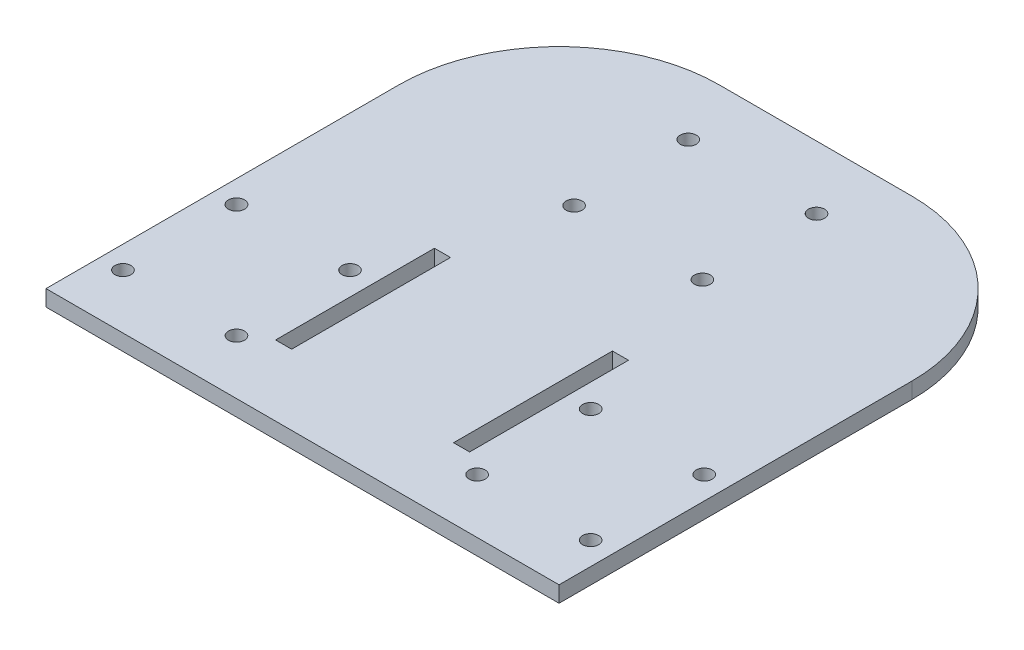
ISO-10303-21;
HEADER;
FILE_DESCRIPTION(('STEP AP214'),'2;1');
FILE_NAME('part.step','',(''),(''),'','','');
FILE_SCHEMA(('AUTOMOTIVE_DESIGN { 1 0 10303 214 1 1 1 1 }'));
ENDSEC;
DATA;
#1=APPLICATION_CONTEXT('core data for automotive mechanical design processes');
#2=APPLICATION_PROTOCOL_DEFINITION('international standard','automotive_design',2000,#1);
#3=PRODUCT_CONTEXT('',#1,'mechanical');
#4=PRODUCT('Part','Part','',(#3));
#5=PRODUCT_RELATED_PRODUCT_CATEGORY('part','',(#4));
#6=PRODUCT_DEFINITION_FORMATION('','',#4);
#7=PRODUCT_DEFINITION_CONTEXT('part definition',#1,'design');
#8=PRODUCT_DEFINITION('design','',#6,#7);
#9=PRODUCT_DEFINITION_SHAPE('','',#8);
#10=(LENGTH_UNIT() NAMED_UNIT(*) SI_UNIT(.MILLI.,.METRE.));
#11=(NAMED_UNIT(*) PLANE_ANGLE_UNIT() SI_UNIT($,.RADIAN.));
#12=(NAMED_UNIT(*) SI_UNIT($,.STERADIAN.) SOLID_ANGLE_UNIT());
#13=UNCERTAINTY_MEASURE_WITH_UNIT(LENGTH_MEASURE(1.E-05),#10,'distance_accuracy_value','');
#14=(GEOMETRIC_REPRESENTATION_CONTEXT(3) GLOBAL_UNCERTAINTY_ASSIGNED_CONTEXT((#13)) GLOBAL_UNIT_ASSIGNED_CONTEXT((#10,
#11,#12)) REPRESENTATION_CONTEXT('',''));
#15=CARTESIAN_POINT('',(0.,0.,0.));
#16=DIRECTION('',(0.,0.,1.));
#17=DIRECTION('',(1.,0.,0.));
#18=AXIS2_PLACEMENT_3D('',#15,#16,#17);
#19=CARTESIAN_POINT('',(101.6,6.35,101.6));
#20=DIRECTION('',(-1.,0.,0.));
#21=DIRECTION('',(0.,0.,1.));
#22=AXIS2_PLACEMENT_3D('',#19,#20,#21);
#23=PLANE('',#22);
#24=DIRECTION('',(0.,1.,0.));
#25=VECTOR('',#24,1.);
#26=CARTESIAN_POINT('',(101.6,0.,-38.0999999999999));
#27=LINE('',#26,#25);
#28=CARTESIAN_POINT('',(101.6,0.,-38.0999999999999));
#29=VERTEX_POINT('',#28);
#30=CARTESIAN_POINT('',(101.6,6.35,-38.0999999999999));
#31=VERTEX_POINT('',#30);
#32=EDGE_CURVE('E252',#29,#31,#27,.T.);
#33=ORIENTED_EDGE('',*,*,#32,.T.);
#34=DIRECTION('',(0.,0.,-1.));
#35=VECTOR('',#34,1.);
#36=CARTESIAN_POINT('',(101.6,6.35,101.6));
#37=LINE('',#36,#35);
#38=CARTESIAN_POINT('',(101.6,6.35,101.6));
#39=VERTEX_POINT('',#38);
#40=EDGE_CURVE('E269',#39,#31,#37,.T.);
#41=ORIENTED_EDGE('',*,*,#40,.F.);
#42=DIRECTION('',(0.,-1.,0.));
#43=VECTOR('',#42,1.);
#44=CARTESIAN_POINT('',(101.6,6.35,101.6));
#45=LINE('',#44,#43);
#46=CARTESIAN_POINT('',(101.6,0.,101.6));
#47=VERTEX_POINT('',#46);
#48=EDGE_CURVE('E39',#39,#47,#45,.T.);
#49=ORIENTED_EDGE('',*,*,#48,.T.);
#50=DIRECTION('',(0.,0.,-1.));
#51=VECTOR('',#50,1.);
#52=CARTESIAN_POINT('',(101.6,0.,101.6));
#53=LINE('',#52,#51);
#54=EDGE_CURVE('E258',#47,#29,#53,.T.);
#55=ORIENTED_EDGE('',*,*,#54,.T.);
#56=EDGE_LOOP('',(#33,#41,#49,#55));
#57=FACE_BOUND('',#56,.T.);
#58=ADVANCED_FACE('F32',(#57),#23,.F.);
#59=CARTESIAN_POINT('',(-101.6,6.35,-101.6));
#60=DIRECTION('',(0.,0.,1.));
#61=DIRECTION('',(1.,0.,0.));
#62=AXIS2_PLACEMENT_3D('',#59,#60,#61);
#63=PLANE('',#62);
#64=DIRECTION('',(-1.,0.,0.));
#65=VECTOR('',#64,1.);
#66=CARTESIAN_POINT('',(-101.6,6.35,-101.6));
#67=LINE('',#66,#65);
#68=CARTESIAN_POINT('',(38.0999999999998,6.35,-101.6));
#69=VERTEX_POINT('',#68);
#70=CARTESIAN_POINT('',(-38.0999999999998,6.35,-101.6));
#71=VERTEX_POINT('',#70);
#72=EDGE_CURVE('E272',#69,#71,#67,.T.);
#73=ORIENTED_EDGE('',*,*,#72,.F.);
#74=DIRECTION('',(0.,1.,0.));
#75=VECTOR('',#74,1.);
#76=CARTESIAN_POINT('',(38.0999999999998,0.,-101.6));
#77=LINE('',#76,#75);
#78=CARTESIAN_POINT('',(38.0999999999998,0.,-101.6));
#79=VERTEX_POINT('',#78);
#80=EDGE_CURVE('E256',#79,#69,#77,.T.);
#81=ORIENTED_EDGE('',*,*,#80,.F.);
#82=DIRECTION('',(-1.,0.,0.));
#83=VECTOR('',#82,1.);
#84=CARTESIAN_POINT('',(-101.6,0.,-101.6));
#85=LINE('',#84,#83);
#86=CARTESIAN_POINT('',(-38.0999999999998,0.,-101.6));
#87=VERTEX_POINT('',#86);
#88=EDGE_CURVE('E282',#79,#87,#85,.T.);
#89=ORIENTED_EDGE('',*,*,#88,.T.);
#90=DIRECTION('',(0.,1.,0.));
#91=VECTOR('',#90,1.);
#92=CARTESIAN_POINT('',(-38.0999999999998,0.,-101.6));
#93=LINE('',#92,#91);
#94=EDGE_CURVE('E264',#87,#71,#93,.T.);
#95=ORIENTED_EDGE('',*,*,#94,.T.);
#96=EDGE_LOOP('',(#73,#81,#89,#95));
#97=FACE_BOUND('',#96,.T.);
#98=ADVANCED_FACE('F305',(#97),#63,.F.);
#99=CARTESIAN_POINT('',(-101.6,6.35,101.6));
#100=DIRECTION('',(1.,0.,0.));
#101=DIRECTION('',(0.,0.,-1.));
#102=AXIS2_PLACEMENT_3D('',#99,#100,#101);
#103=PLANE('',#102);
#104=DIRECTION('',(0.,0.,1.));
#105=VECTOR('',#104,1.);
#106=CARTESIAN_POINT('',(-101.6,6.35,101.6));
#107=LINE('',#106,#105);
#108=CARTESIAN_POINT('',(-101.6,6.35,-38.0999999999999));
#109=VERTEX_POINT('',#108);
#110=CARTESIAN_POINT('',(-101.6,6.35,101.6));
#111=VERTEX_POINT('',#110);
#112=EDGE_CURVE('E276',#109,#111,#107,.T.);
#113=ORIENTED_EDGE('',*,*,#112,.F.);
#114=DIRECTION('',(0.,1.,0.));
#115=VECTOR('',#114,1.);
#116=CARTESIAN_POINT('',(-101.6,0.,-38.0999999999999));
#117=LINE('',#116,#115);
#118=CARTESIAN_POINT('',(-101.6,0.,-38.0999999999999));
#119=VERTEX_POINT('',#118);
#120=EDGE_CURVE('E255',#119,#109,#117,.T.);
#121=ORIENTED_EDGE('',*,*,#120,.F.);
#122=DIRECTION('',(0.,0.,1.));
#123=VECTOR('',#122,1.);
#124=CARTESIAN_POINT('',(-101.6,0.,101.6));
#125=LINE('',#124,#123);
#126=CARTESIAN_POINT('',(-101.6,0.,101.6));
#127=VERTEX_POINT('',#126);
#128=EDGE_CURVE('E285',#119,#127,#125,.T.);
#129=ORIENTED_EDGE('',*,*,#128,.T.);
#130=DIRECTION('',(0.,-1.,0.));
#131=VECTOR('',#130,1.);
#132=CARTESIAN_POINT('',(-101.6,6.35,101.6));
#133=LINE('',#132,#131);
#134=EDGE_CURVE('E11',#111,#127,#133,.T.);
#135=ORIENTED_EDGE('',*,*,#134,.F.);
#136=EDGE_LOOP('',(#113,#121,#129,#135));
#137=FACE_BOUND('',#136,.T.);
#138=ADVANCED_FACE('F312',(#137),#103,.F.);
#139=CARTESIAN_POINT('',(-101.6,6.35,101.6));
#140=DIRECTION('',(0.,0.,-1.));
#141=DIRECTION('',(-1.,0.,0.));
#142=AXIS2_PLACEMENT_3D('',#139,#140,#141);
#143=PLANE('',#142);
#144=DIRECTION('',(1.,0.,0.));
#145=VECTOR('',#144,1.);
#146=CARTESIAN_POINT('',(-101.6,0.,101.6));
#147=LINE('',#146,#145);
#148=EDGE_CURVE('E273',#127,#47,#147,.T.);
#149=ORIENTED_EDGE('',*,*,#148,.T.);
#150=ORIENTED_EDGE('',*,*,#48,.F.);
#151=DIRECTION('',(1.,0.,0.));
#152=VECTOR('',#151,1.);
#153=CARTESIAN_POINT('',(-101.6,6.35,101.6));
#154=LINE('',#153,#152);
#155=EDGE_CURVE('E278',#111,#39,#154,.T.);
#156=ORIENTED_EDGE('',*,*,#155,.F.);
#157=ORIENTED_EDGE('',*,*,#134,.T.);
#158=EDGE_LOOP('',(#149,#150,#156,#157));
#159=FACE_BOUND('',#158,.T.);
#160=ADVANCED_FACE('F310',(#159),#143,.F.);
#161=CARTESIAN_POINT('',(0.,6.35,0.));
#162=DIRECTION('',(0.,-1.,0.));
#163=DIRECTION('',(0.,0.,-1.));
#164=AXIS2_PLACEMENT_3D('',#161,#162,#163);
#165=PLANE('',#164);
#166=DIRECTION('',(-1.,0.,0.));
#167=VECTOR('',#166,1.);
#168=CARTESIAN_POINT('',(-38.5120386701626,6.35,73.7559613298375));
#169=LINE('',#168,#167);
#170=CARTESIAN_POINT('',(-32.1620386701625,6.35,73.7559613298375));
#171=VERTEX_POINT('',#170);
#172=CARTESIAN_POINT('',(-38.5120386701626,6.35,73.7559613298375));
#173=VERTEX_POINT('',#172);
#174=EDGE_CURVE('E191',#171,#173,#169,.T.);
#175=ORIENTED_EDGE('',*,*,#174,.T.);
#176=DIRECTION('',(0.,0.,-1.));
#177=VECTOR('',#176,1.);
#178=CARTESIAN_POINT('',(-38.5120386701626,6.35,10.8317438789309));
#179=LINE('',#178,#177);
#180=CARTESIAN_POINT('',(-38.5120386701626,6.35,10.8317438789309));
#181=VERTEX_POINT('',#180);
#182=EDGE_CURVE('E183',#173,#181,#179,.T.);
#183=ORIENTED_EDGE('',*,*,#182,.T.);
#184=DIRECTION('',(1.,0.,0.));
#185=VECTOR('',#184,1.);
#186=CARTESIAN_POINT('',(-38.5120386701626,6.35,10.8317438789309));
#187=LINE('',#186,#185);
#188=CARTESIAN_POINT('',(-32.1620386701625,6.35,10.8317438789309));
#189=VERTEX_POINT('',#188);
#190=EDGE_CURVE('E186',#181,#189,#187,.T.);
#191=ORIENTED_EDGE('',*,*,#190,.T.);
#192=DIRECTION('',(0.,0.,1.));
#193=VECTOR('',#192,1.);
#194=CARTESIAN_POINT('',(-32.1620386701625,6.35,10.8317438789309));
#195=LINE('',#194,#193);
#196=EDGE_CURVE('E46',#189,#171,#195,.T.);
#197=ORIENTED_EDGE('',*,*,#196,.T.);
#198=EDGE_LOOP('',(#175,#183,#191,#197));
#199=FACE_BOUND('',#198,.T.);
#200=CARTESIAN_POINT('',(-92.71,6.35,80.0157052087683));
#201=DIRECTION('',(0.,-1.,0.));
#202=DIRECTION('',(0.,0.,-1.));
#203=AXIS2_PLACEMENT_3D('',#200,#201,#202);
#204=CIRCLE('',#203,3.175);
#205=CARTESIAN_POINT('',(-92.71,6.35,76.8407052087683));
#206=VERTEX_POINT('',#205);
#207=EDGE_CURVE('E198',#206,#206,#204,.T.);
#208=ORIENTED_EDGE('',*,*,#207,.T.);
#209=EDGE_LOOP('',(#208));
#210=FACE_BOUND('',#209,.T.);
#211=DIRECTION('',(0.,0.,-1.));
#212=VECTOR('',#211,1.);
#213=CARTESIAN_POINT('',(31.9815264280242,6.35,73.7559613298375));
#214=LINE('',#213,#212);
#215=CARTESIAN_POINT('',(31.9815264280242,6.35,73.7559613298375));
#216=VERTEX_POINT('',#215);
#217=CARTESIAN_POINT('',(31.9815264280242,6.35,10.8317438789307));
#218=VERTEX_POINT('',#217);
#219=EDGE_CURVE('E144',#216,#218,#214,.T.);
#220=ORIENTED_EDGE('',*,*,#219,.T.);
#221=DIRECTION('',(1.,0.,0.));
#222=VECTOR('',#221,1.);
#223=CARTESIAN_POINT('',(38.3315264280242,6.35,10.8317438789307));
#224=LINE('',#223,#222);
#225=CARTESIAN_POINT('',(38.3315264280242,6.35,10.8317438789307));
#226=VERTEX_POINT('',#225);
#227=EDGE_CURVE('E136',#218,#226,#224,.T.);
#228=ORIENTED_EDGE('',*,*,#227,.T.);
#229=DIRECTION('',(0.,0.,1.));
#230=VECTOR('',#229,1.);
#231=CARTESIAN_POINT('',(38.3315264280242,6.35,73.7559613298375));
#232=LINE('',#231,#230);
#233=CARTESIAN_POINT('',(38.3315264280242,6.35,73.7559613298375));
#234=VERTEX_POINT('',#233);
#235=EDGE_CURVE('E147',#226,#234,#232,.T.);
#236=ORIENTED_EDGE('',*,*,#235,.T.);
#237=DIRECTION('',(-1.,0.,0.));
#238=VECTOR('',#237,1.);
#239=CARTESIAN_POINT('',(38.3315264280242,6.35,73.7559613298375));
#240=LINE('',#239,#238);
#241=EDGE_CURVE('E54',#234,#216,#240,.T.);
#242=ORIENTED_EDGE('',*,*,#241,.T.);
#243=EDGE_LOOP('',(#220,#228,#236,#242));
#244=FACE_BOUND('',#243,.T.);
#245=CARTESIAN_POINT('',(-47.7462947912317,6.35,35.0520000000001));
#246=DIRECTION('',(0.,-1.,0.));
#247=DIRECTION('',(0.,0.,-1.));
#248=AXIS2_PLACEMENT_3D('',#245,#246,#247);
#249=CIRCLE('',#248,3.16000827881765);
#250=CARTESIAN_POINT('',(-47.7462947912317,6.35,31.8919917211824));
#251=VERTEX_POINT('',#250);
#252=EDGE_CURVE('E167',#251,#251,#249,.T.);
#253=ORIENTED_EDGE('',*,*,#252,.T.);
#254=EDGE_LOOP('',(#253));
#255=FACE_BOUND('',#254,.T.);
#256=CARTESIAN_POINT('',(25.3097438789308,6.35,-31.4508386701625));
#257=DIRECTION('',(0.,-1.,0.));
#258=DIRECTION('',(0.,0.,-1.));
#259=AXIS2_PLACEMENT_3D('',#256,#257,#258);
#260=CIRCLE('',#259,3.175);
#261=CARTESIAN_POINT('',(25.3097438789308,6.35,-34.6258386701625));
#262=VERTEX_POINT('',#261);
#263=EDGE_CURVE('E231',#262,#262,#260,.T.);
#264=ORIENTED_EDGE('',*,*,#263,.T.);
#265=EDGE_LOOP('',(#264));
#266=FACE_BOUND('',#265,.T.);
#267=CARTESIAN_POINT('',(-25.4902561210691,6.35,-76.6628386701625));
#268=DIRECTION('',(0.,-1.,0.));
#269=DIRECTION('',(0.,0.,-1.));
#270=AXIS2_PLACEMENT_3D('',#267,#268,#269);
#271=CIRCLE('',#270,3.175);
#272=CARTESIAN_POINT('',(-25.4902561210691,6.35,-79.8378386701625));
#273=VERTEX_POINT('',#272);
#274=EDGE_CURVE('E238',#273,#273,#271,.T.);
#275=ORIENTED_EDGE('',*,*,#274,.T.);
#276=EDGE_LOOP('',(#275));
#277=FACE_BOUND('',#276,.T.);
#278=CARTESIAN_POINT('',(25.3097438789308,6.35,-76.6628386701625));
#279=DIRECTION('',(0.,-1.,0.));
#280=DIRECTION('',(0.,0.,-1.));
#281=AXIS2_PLACEMENT_3D('',#278,#279,#280);
#282=CIRCLE('',#281,3.175);
#283=CARTESIAN_POINT('',(25.3097438789308,6.35,-79.8378386701625));
#284=VERTEX_POINT('',#283);
#285=EDGE_CURVE('E219',#284,#284,#282,.T.);
#286=ORIENTED_EDGE('',*,*,#285,.T.);
#287=EDGE_LOOP('',(#286));
#288=FACE_BOUND('',#287,.T.);
#289=CARTESIAN_POINT('',(-47.7462947912317,6.35,80.0157052087683));
#290=DIRECTION('',(0.,-1.,0.));
#291=DIRECTION('',(0.,0.,-1.));
#292=AXIS2_PLACEMENT_3D('',#289,#290,#291);
#293=CIRCLE('',#292,3.175);
#294=CARTESIAN_POINT('',(-47.7462947912317,6.35,76.8407052087683));
#295=VERTEX_POINT('',#294);
#296=EDGE_CURVE('E226',#295,#295,#293,.T.);
#297=ORIENTED_EDGE('',*,*,#296,.T.);
#298=EDGE_LOOP('',(#297));
#299=FACE_BOUND('',#298,.T.);
#300=CARTESIAN_POINT('',(92.5294877578617,6.35,35.052));
#301=DIRECTION('',(0.,-1.,0.));
#302=DIRECTION('',(0.,0.,-1.));
#303=AXIS2_PLACEMENT_3D('',#300,#301,#302);
#304=CIRCLE('',#303,3.175);
#305=CARTESIAN_POINT('',(92.5294877578617,6.35,31.877));
#306=VERTEX_POINT('',#305);
#307=EDGE_CURVE('E464',#306,#306,#304,.T.);
#308=ORIENTED_EDGE('',*,*,#307,.T.);
#309=EDGE_LOOP('',(#308));
#310=FACE_BOUND('',#309,.T.);
#311=CARTESIAN_POINT('',(-92.71,6.35,35.052));
#312=DIRECTION('',(0.,-1.,0.));
#313=DIRECTION('',(0.,0.,-1.));
#314=AXIS2_PLACEMENT_3D('',#311,#312,#313);
#315=CIRCLE('',#314,3.20575002945102);
#316=CARTESIAN_POINT('',(-92.71,6.35,31.846249970549));
#317=VERTEX_POINT('',#316);
#318=EDGE_CURVE('E182',#317,#317,#315,.T.);
#319=ORIENTED_EDGE('',*,*,#318,.T.);
#320=EDGE_LOOP('',(#319));
#321=FACE_BOUND('',#320,.T.);
#322=CARTESIAN_POINT('',(47.5657825490934,6.35,80.0157052087683));
#323=DIRECTION('',(0.,-1.,0.));
#324=DIRECTION('',(0.,0.,-1.));
#325=AXIS2_PLACEMENT_3D('',#322,#323,#324);
#326=CIRCLE('',#325,3.175);
#327=CARTESIAN_POINT('',(47.5657825490934,6.35,76.8407052087683));
#328=VERTEX_POINT('',#327);
#329=EDGE_CURVE('E478',#328,#328,#326,.T.);
#330=ORIENTED_EDGE('',*,*,#329,.T.);
#331=EDGE_LOOP('',(#330));
#332=FACE_BOUND('',#331,.T.);
#333=CARTESIAN_POINT('',(92.5294877578616,6.35,80.0157052087682));
#334=DIRECTION('',(0.,-1.,0.));
#335=DIRECTION('',(0.,0.,-1.));
#336=AXIS2_PLACEMENT_3D('',#333,#334,#335);
#337=CIRCLE('',#336,3.175);
#338=CARTESIAN_POINT('',(92.5294877578616,6.35,76.8407052087682));
#339=VERTEX_POINT('',#338);
#340=EDGE_CURVE('E468',#339,#339,#337,.T.);
#341=ORIENTED_EDGE('',*,*,#340,.T.);
#342=EDGE_LOOP('',(#341));
#343=FACE_BOUND('',#342,.T.);
#344=CARTESIAN_POINT('',(47.5657825490934,6.35,35.052));
#345=DIRECTION('',(0.,-1.,0.));
#346=DIRECTION('',(0.,0.,-1.));
#347=AXIS2_PLACEMENT_3D('',#344,#345,#346);
#348=CIRCLE('',#347,3.175);
#349=CARTESIAN_POINT('',(47.5657825490934,6.35,31.877));
#350=VERTEX_POINT('',#349);
#351=EDGE_CURVE('E472',#350,#350,#348,.T.);
#352=ORIENTED_EDGE('',*,*,#351,.T.);
#353=EDGE_LOOP('',(#352));
#354=FACE_BOUND('',#353,.T.);
#355=CARTESIAN_POINT('',(-25.4902561210691,6.35,-31.4508386701625));
#356=DIRECTION('',(0.,-1.,0.));
#357=DIRECTION('',(0.,0.,-1.));
#358=AXIS2_PLACEMENT_3D('',#355,#356,#357);
#359=CIRCLE('',#358,3.175);
#360=CARTESIAN_POINT('',(-25.4902561210691,6.35,-34.6258386701625));
#361=VERTEX_POINT('',#360);
#362=EDGE_CURVE('E243',#361,#361,#359,.T.);
#363=ORIENTED_EDGE('',*,*,#362,.T.);
#364=EDGE_LOOP('',(#363));
#365=FACE_BOUND('',#364,.T.);
#366=ORIENTED_EDGE('',*,*,#40,.T.);
#367=CARTESIAN_POINT('',(38.0999999999998,6.35,-38.0999999999999));
#368=DIRECTION('',(0.,-1.,0.));
#369=DIRECTION('',(0.,0.,1.));
#370=AXIS2_PLACEMENT_3D('',#367,#368,#369);
#371=CIRCLE('',#370,63.5000000000001);
#372=EDGE_CURVE('E253',#69,#31,#371,.T.);
#373=ORIENTED_EDGE('',*,*,#372,.F.);
#374=ORIENTED_EDGE('',*,*,#72,.T.);
#375=CARTESIAN_POINT('',(-38.0999999999998,6.35,-38.0999999999999));
#376=DIRECTION('',(0.,-1.,0.));
#377=DIRECTION('',(0.,0.,-1.));
#378=AXIS2_PLACEMENT_3D('',#375,#376,#377);
#379=CIRCLE('',#378,63.5000000000001);
#380=EDGE_CURVE('E246',#109,#71,#379,.T.);
#381=ORIENTED_EDGE('',*,*,#380,.F.);
#382=ORIENTED_EDGE('',*,*,#112,.T.);
#383=ORIENTED_EDGE('',*,*,#155,.T.);
#384=EDGE_LOOP('',(#366,#373,#374,#381,#382,#383));
#385=FACE_BOUND('',#384,.T.);
#386=ADVANCED_FACE('F151',(#199,#210,#244,#255,#266,#277,#288,#299,#310,#321,#332,#343,#354,
#365,#385),#165,.F.);
#387=CARTESIAN_POINT('',(0.,0.,0.));
#388=DIRECTION('',(0.,-1.,0.));
#389=DIRECTION('',(0.,0.,-1.));
#390=AXIS2_PLACEMENT_3D('',#387,#388,#389);
#391=PLANE('',#390);
#392=DIRECTION('',(0.,0.,-1.));
#393=VECTOR('',#392,1.);
#394=CARTESIAN_POINT('',(-38.5120386701626,0.,10.8317438789309));
#395=LINE('',#394,#393);
#396=CARTESIAN_POINT('',(-38.5120386701626,0.,73.7559613298375));
#397=VERTEX_POINT('',#396);
#398=CARTESIAN_POINT('',(-38.5120386701626,0.,10.8317438789309));
#399=VERTEX_POINT('',#398);
#400=EDGE_CURVE('E195',#397,#399,#395,.T.);
#401=ORIENTED_EDGE('',*,*,#400,.F.);
#402=DIRECTION('',(-1.,0.,0.));
#403=VECTOR('',#402,1.);
#404=CARTESIAN_POINT('',(-38.5120386701626,0.,73.7559613298375));
#405=LINE('',#404,#403);
#406=CARTESIAN_POINT('',(-32.1620386701625,0.,73.7559613298375));
#407=VERTEX_POINT('',#406);
#408=EDGE_CURVE('E187',#407,#397,#405,.T.);
#409=ORIENTED_EDGE('',*,*,#408,.F.);
#410=DIRECTION('',(0.,0.,1.));
#411=VECTOR('',#410,1.);
#412=CARTESIAN_POINT('',(-32.1620386701625,0.,10.8317438789309));
#413=LINE('',#412,#411);
#414=CARTESIAN_POINT('',(-32.1620386701625,0.,10.8317438789309));
#415=VERTEX_POINT('',#414);
#416=EDGE_CURVE('E201',#415,#407,#413,.T.);
#417=ORIENTED_EDGE('',*,*,#416,.F.);
#418=DIRECTION('',(1.,0.,0.));
#419=VECTOR('',#418,1.);
#420=CARTESIAN_POINT('',(-38.5120386701626,0.,10.8317438789309));
#421=LINE('',#420,#419);
#422=EDGE_CURVE('E197',#399,#415,#421,.T.);
#423=ORIENTED_EDGE('',*,*,#422,.F.);
#424=EDGE_LOOP('',(#401,#409,#417,#423));
#425=FACE_BOUND('',#424,.T.);
#426=CARTESIAN_POINT('',(-92.71,0.,80.0157052087683));
#427=DIRECTION('',(0.,-1.,0.));
#428=DIRECTION('',(0.,0.,-1.));
#429=AXIS2_PLACEMENT_3D('',#426,#427,#428);
#430=CIRCLE('',#429,3.175);
#431=CARTESIAN_POINT('',(-92.71,0.,76.8407052087683));
#432=VERTEX_POINT('',#431);
#433=EDGE_CURVE('E173',#432,#432,#430,.T.);
#434=ORIENTED_EDGE('',*,*,#433,.F.);
#435=EDGE_LOOP('',(#434));
#436=FACE_BOUND('',#435,.T.);
#437=DIRECTION('',(1.,0.,0.));
#438=VECTOR('',#437,1.);
#439=CARTESIAN_POINT('',(38.3315264280242,0.,10.8317438789307));
#440=LINE('',#439,#438);
#441=CARTESIAN_POINT('',(31.9815264280242,0.,10.8317438789307));
#442=VERTEX_POINT('',#441);
#443=CARTESIAN_POINT('',(38.3315264280242,0.,10.8317438789307));
#444=VERTEX_POINT('',#443);
#445=EDGE_CURVE('E139',#442,#444,#440,.T.);
#446=ORIENTED_EDGE('',*,*,#445,.F.);
#447=DIRECTION('',(0.,0.,-1.));
#448=VECTOR('',#447,1.);
#449=CARTESIAN_POINT('',(31.9815264280242,0.,73.7559613298375));
#450=LINE('',#449,#448);
#451=CARTESIAN_POINT('',(31.9815264280242,0.,73.7559613298375));
#452=VERTEX_POINT('',#451);
#453=EDGE_CURVE('E154',#452,#442,#450,.T.);
#454=ORIENTED_EDGE('',*,*,#453,.F.);
#455=DIRECTION('',(-1.,0.,0.));
#456=VECTOR('',#455,1.);
#457=CARTESIAN_POINT('',(38.3315264280242,0.,73.7559613298375));
#458=LINE('',#457,#456);
#459=CARTESIAN_POINT('',(38.3315264280242,0.,73.7559613298375));
#460=VERTEX_POINT('',#459);
#461=EDGE_CURVE('E157',#460,#452,#458,.T.);
#462=ORIENTED_EDGE('',*,*,#461,.F.);
#463=DIRECTION('',(0.,0.,1.));
#464=VECTOR('',#463,1.);
#465=CARTESIAN_POINT('',(38.3315264280242,0.,73.7559613298375));
#466=LINE('',#465,#464);
#467=EDGE_CURVE('E166',#444,#460,#466,.T.);
#468=ORIENTED_EDGE('',*,*,#467,.F.);
#469=EDGE_LOOP('',(#446,#454,#462,#468));
#470=FACE_BOUND('',#469,.T.);
#471=CARTESIAN_POINT('',(-47.7462947912317,0.,35.0520000000001));
#472=DIRECTION('',(0.,-1.,0.));
#473=DIRECTION('',(0.,0.,-1.));
#474=AXIS2_PLACEMENT_3D('',#471,#472,#473);
#475=CIRCLE('',#474,3.16000827881765);
#476=CARTESIAN_POINT('',(-47.7462947912317,0.,31.8919917211824));
#477=VERTEX_POINT('',#476);
#478=EDGE_CURVE('E179',#477,#477,#475,.T.);
#479=ORIENTED_EDGE('',*,*,#478,.F.);
#480=EDGE_LOOP('',(#479));
#481=FACE_BOUND('',#480,.T.);
#482=CARTESIAN_POINT('',(25.3097438789308,0.,-31.4508386701625));
#483=DIRECTION('',(0.,-1.,0.));
#484=DIRECTION('',(0.,0.,-1.));
#485=AXIS2_PLACEMENT_3D('',#482,#483,#484);
#486=CIRCLE('',#485,3.175);
#487=CARTESIAN_POINT('',(25.3097438789308,0.,-34.6258386701625));
#488=VERTEX_POINT('',#487);
#489=EDGE_CURVE('E235',#488,#488,#486,.T.);
#490=ORIENTED_EDGE('',*,*,#489,.F.);
#491=EDGE_LOOP('',(#490));
#492=FACE_BOUND('',#491,.T.);
#493=CARTESIAN_POINT('',(-25.4902561210691,0.,-76.6628386701625));
#494=DIRECTION('',(0.,-1.,0.));
#495=DIRECTION('',(0.,0.,-1.));
#496=AXIS2_PLACEMENT_3D('',#493,#494,#495);
#497=CIRCLE('',#496,3.175);
#498=CARTESIAN_POINT('',(-25.4902561210691,0.,-79.8378386701625));
#499=VERTEX_POINT('',#498);
#500=EDGE_CURVE('E222',#499,#499,#497,.T.);
#501=ORIENTED_EDGE('',*,*,#500,.F.);
#502=EDGE_LOOP('',(#501));
#503=FACE_BOUND('',#502,.T.);
#504=CARTESIAN_POINT('',(25.3097438789308,0.,-76.6628386701625));
#505=DIRECTION('',(0.,-1.,0.));
#506=DIRECTION('',(0.,0.,-1.));
#507=AXIS2_PLACEMENT_3D('',#504,#505,#506);
#508=CIRCLE('',#507,3.175);
#509=CARTESIAN_POINT('',(25.3097438789308,0.,-79.8378386701625));
#510=VERTEX_POINT('',#509);
#511=EDGE_CURVE('E223',#510,#510,#508,.T.);
#512=ORIENTED_EDGE('',*,*,#511,.F.);
#513=EDGE_LOOP('',(#512));
#514=FACE_BOUND('',#513,.T.);
#515=CARTESIAN_POINT('',(-47.7462947912317,0.,80.0157052087683));
#516=DIRECTION('',(0.,-1.,0.));
#517=DIRECTION('',(0.,0.,-1.));
#518=AXIS2_PLACEMENT_3D('',#515,#516,#517);
#519=CIRCLE('',#518,3.175);
#520=CARTESIAN_POINT('',(-47.7462947912317,0.,76.8407052087683));
#521=VERTEX_POINT('',#520);
#522=EDGE_CURVE('E208',#521,#521,#519,.T.);
#523=ORIENTED_EDGE('',*,*,#522,.F.);
#524=EDGE_LOOP('',(#523));
#525=FACE_BOUND('',#524,.T.);
#526=CARTESIAN_POINT('',(92.5294877578617,0.,35.052));
#527=DIRECTION('',(0.,-1.,0.));
#528=DIRECTION('',(0.,0.,-1.));
#529=AXIS2_PLACEMENT_3D('',#526,#527,#528);
#530=CIRCLE('',#529,3.175);
#531=CARTESIAN_POINT('',(92.5294877578617,0.,31.877));
#532=VERTEX_POINT('',#531);
#533=EDGE_CURVE('E370',#532,#532,#530,.T.);
#534=ORIENTED_EDGE('',*,*,#533,.F.);
#535=EDGE_LOOP('',(#534));
#536=FACE_BOUND('',#535,.T.);
#537=CARTESIAN_POINT('',(-92.71,0.,35.052));
#538=DIRECTION('',(0.,-1.,0.));
#539=DIRECTION('',(0.,0.,-1.));
#540=AXIS2_PLACEMENT_3D('',#537,#538,#539);
#541=CIRCLE('',#540,3.20575002945102);
#542=CARTESIAN_POINT('',(-92.71,0.,31.846249970549));
#543=VERTEX_POINT('',#542);
#544=EDGE_CURVE('E374',#543,#543,#541,.T.);
#545=ORIENTED_EDGE('',*,*,#544,.F.);
#546=EDGE_LOOP('',(#545));
#547=FACE_BOUND('',#546,.T.);
#548=CARTESIAN_POINT('',(47.5657825490934,0.,80.0157052087683));
#549=DIRECTION('',(0.,-1.,0.));
#550=DIRECTION('',(0.,0.,-1.));
#551=AXIS2_PLACEMENT_3D('',#548,#549,#550);
#552=CIRCLE('',#551,3.175);
#553=CARTESIAN_POINT('',(47.5657825490934,0.,76.8407052087683));
#554=VERTEX_POINT('',#553);
#555=EDGE_CURVE('E160',#554,#554,#552,.T.);
#556=ORIENTED_EDGE('',*,*,#555,.F.);
#557=EDGE_LOOP('',(#556));
#558=FACE_BOUND('',#557,.T.);
#559=CARTESIAN_POINT('',(92.5294877578616,0.,80.0157052087682));
#560=DIRECTION('',(0.,-1.,0.));
#561=DIRECTION('',(0.,0.,-1.));
#562=AXIS2_PLACEMENT_3D('',#559,#560,#561);
#563=CIRCLE('',#562,3.175);
#564=CARTESIAN_POINT('',(92.5294877578616,0.,76.8407052087682));
#565=VERTEX_POINT('',#564);
#566=EDGE_CURVE('E381',#565,#565,#563,.T.);
#567=ORIENTED_EDGE('',*,*,#566,.F.);
#568=EDGE_LOOP('',(#567));
#569=FACE_BOUND('',#568,.T.);
#570=CARTESIAN_POINT('',(47.5657825490934,0.,35.052));
#571=DIRECTION('',(0.,-1.,0.));
#572=DIRECTION('',(0.,0.,-1.));
#573=AXIS2_PLACEMENT_3D('',#570,#571,#572);
#574=CIRCLE('',#573,3.175);
#575=CARTESIAN_POINT('',(47.5657825490934,0.,31.877));
#576=VERTEX_POINT('',#575);
#577=EDGE_CURVE('E385',#576,#576,#574,.T.);
#578=ORIENTED_EDGE('',*,*,#577,.F.);
#579=EDGE_LOOP('',(#578));
#580=FACE_BOUND('',#579,.T.);
#581=CARTESIAN_POINT('',(-25.4902561210691,0.,-31.4508386701625));
#582=DIRECTION('',(0.,-1.,0.));
#583=DIRECTION('',(0.,0.,-1.));
#584=AXIS2_PLACEMENT_3D('',#581,#582,#583);
#585=CIRCLE('',#584,3.175);
#586=CARTESIAN_POINT('',(-25.4902561210691,0.,-34.6258386701625));
#587=VERTEX_POINT('',#586);
#588=EDGE_CURVE('E234',#587,#587,#585,.T.);
#589=ORIENTED_EDGE('',*,*,#588,.F.);
#590=EDGE_LOOP('',(#589));
#591=FACE_BOUND('',#590,.T.);
#592=CARTESIAN_POINT('',(38.0999999999998,0.,-38.0999999999999));
#593=DIRECTION('',(0.,-1.,0.));
#594=DIRECTION('',(0.,0.,1.));
#595=AXIS2_PLACEMENT_3D('',#592,#593,#594);
#596=CIRCLE('',#595,63.5000000000001);
#597=EDGE_CURVE('E249',#79,#29,#596,.T.);
#598=ORIENTED_EDGE('',*,*,#597,.T.);
#599=ORIENTED_EDGE('',*,*,#54,.F.);
#600=ORIENTED_EDGE('',*,*,#148,.F.);
#601=ORIENTED_EDGE('',*,*,#128,.F.);
#602=CARTESIAN_POINT('',(-38.0999999999998,0.,-38.0999999999999));
#603=DIRECTION('',(0.,-1.,0.));
#604=DIRECTION('',(0.,0.,-1.));
#605=AXIS2_PLACEMENT_3D('',#602,#603,#604);
#606=CIRCLE('',#605,63.5000000000001);
#607=EDGE_CURVE('E261',#119,#87,#606,.T.);
#608=ORIENTED_EDGE('',*,*,#607,.T.);
#609=ORIENTED_EDGE('',*,*,#88,.F.);
#610=EDGE_LOOP('',(#598,#599,#600,#601,#608,#609));
#611=FACE_BOUND('',#610,.T.);
#612=ADVANCED_FACE('F296',(#425,#436,#470,#481,#492,#503,#514,#525,#536,#547,#558,#569,#580,
#591,#611),#391,.T.);
#613=CARTESIAN_POINT('',(-38.0999999999998,0.,-38.0999999999999));
#614=DIRECTION('',(0.,1.,0.));
#615=DIRECTION('',(0.,0.,1.));
#616=AXIS2_PLACEMENT_3D('',#613,#614,#615);
#617=CYLINDRICAL_SURFACE('',#616,63.5000000000001);
#618=ORIENTED_EDGE('',*,*,#380,.T.);
#619=ORIENTED_EDGE('',*,*,#94,.F.);
#620=ORIENTED_EDGE('',*,*,#607,.F.);
#621=ORIENTED_EDGE('',*,*,#120,.T.);
#622=EDGE_LOOP('',(#618,#619,#620,#621));
#623=FACE_BOUND('',#622,.T.);
#624=ADVANCED_FACE('F315',(#623),#617,.T.);
#625=CARTESIAN_POINT('',(38.0999999999998,0.,-38.0999999999999));
#626=DIRECTION('',(0.,1.,0.));
#627=DIRECTION('',(0.,0.,1.));
#628=AXIS2_PLACEMENT_3D('',#625,#626,#627);
#629=CYLINDRICAL_SURFACE('',#628,63.5000000000001);
#630=ORIENTED_EDGE('',*,*,#372,.T.);
#631=ORIENTED_EDGE('',*,*,#32,.F.);
#632=ORIENTED_EDGE('',*,*,#597,.F.);
#633=ORIENTED_EDGE('',*,*,#80,.T.);
#634=EDGE_LOOP('',(#630,#631,#632,#633));
#635=FACE_BOUND('',#634,.T.);
#636=ADVANCED_FACE('F301',(#635),#629,.T.);
#637=CARTESIAN_POINT('',(-25.4902561210691,6.35,-31.4508386701625));
#638=DIRECTION('',(0.,-1.,0.));
#639=DIRECTION('',(0.,0.,-1.));
#640=AXIS2_PLACEMENT_3D('',#637,#638,#639);
#641=CYLINDRICAL_SURFACE('',#640,3.175);
#642=ORIENTED_EDGE('',*,*,#362,.F.);
#643=EDGE_LOOP('',(#642));
#644=FACE_BOUND('',#643,.T.);
#645=ORIENTED_EDGE('',*,*,#588,.T.);
#646=EDGE_LOOP('',(#645));
#647=FACE_BOUND('',#646,.T.);
#648=ADVANCED_FACE('F322',(#644,#647),#641,.F.);
#649=CARTESIAN_POINT('',(47.5657825490934,6.35,35.052));
#650=DIRECTION('',(0.,-1.,0.));
#651=DIRECTION('',(0.,0.,-1.));
#652=AXIS2_PLACEMENT_3D('',#649,#650,#651);
#653=CYLINDRICAL_SURFACE('',#652,3.175);
#654=ORIENTED_EDGE('',*,*,#351,.F.);
#655=EDGE_LOOP('',(#654));
#656=FACE_BOUND('',#655,.T.);
#657=ORIENTED_EDGE('',*,*,#577,.T.);
#658=EDGE_LOOP('',(#657));
#659=FACE_BOUND('',#658,.T.);
#660=ADVANCED_FACE('F389',(#656,#659),#653,.F.);
#661=CARTESIAN_POINT('',(92.5294877578616,6.35,80.0157052087682));
#662=DIRECTION('',(0.,-1.,0.));
#663=DIRECTION('',(0.,0.,-1.));
#664=AXIS2_PLACEMENT_3D('',#661,#662,#663);
#665=CYLINDRICAL_SURFACE('',#664,3.175);
#666=ORIENTED_EDGE('',*,*,#340,.F.);
#667=EDGE_LOOP('',(#666));
#668=FACE_BOUND('',#667,.T.);
#669=ORIENTED_EDGE('',*,*,#566,.T.);
#670=EDGE_LOOP('',(#669));
#671=FACE_BOUND('',#670,.T.);
#672=ADVANCED_FACE('F395',(#668,#671),#665,.F.);
#673=CARTESIAN_POINT('',(47.5657825490934,6.35,80.0157052087683));
#674=DIRECTION('',(0.,-1.,0.));
#675=DIRECTION('',(0.,0.,-1.));
#676=AXIS2_PLACEMENT_3D('',#673,#674,#675);
#677=CYLINDRICAL_SURFACE('',#676,3.175);
#678=ORIENTED_EDGE('',*,*,#329,.F.);
#679=EDGE_LOOP('',(#678));
#680=FACE_BOUND('',#679,.T.);
#681=ORIENTED_EDGE('',*,*,#555,.T.);
#682=EDGE_LOOP('',(#681));
#683=FACE_BOUND('',#682,.T.);
#684=ADVANCED_FACE('F446',(#680,#683),#677,.F.);
#685=CARTESIAN_POINT('',(-92.71,6.35,35.052));
#686=DIRECTION('',(0.,-1.,0.));
#687=DIRECTION('',(0.,0.,-1.));
#688=AXIS2_PLACEMENT_3D('',#685,#686,#687);
#689=CYLINDRICAL_SURFACE('',#688,3.20575002945102);
#690=ORIENTED_EDGE('',*,*,#318,.F.);
#691=EDGE_LOOP('',(#690));
#692=FACE_BOUND('',#691,.T.);
#693=ORIENTED_EDGE('',*,*,#544,.T.);
#694=EDGE_LOOP('',(#693));
#695=FACE_BOUND('',#694,.T.);
#696=ADVANCED_FACE('F449',(#692,#695),#689,.F.);
#697=CARTESIAN_POINT('',(92.5294877578617,6.35,35.052));
#698=DIRECTION('',(0.,-1.,0.));
#699=DIRECTION('',(0.,0.,-1.));
#700=AXIS2_PLACEMENT_3D('',#697,#698,#699);
#701=CYLINDRICAL_SURFACE('',#700,3.175);
#702=ORIENTED_EDGE('',*,*,#307,.F.);
#703=EDGE_LOOP('',(#702));
#704=FACE_BOUND('',#703,.T.);
#705=ORIENTED_EDGE('',*,*,#533,.T.);
#706=EDGE_LOOP('',(#705));
#707=FACE_BOUND('',#706,.T.);
#708=ADVANCED_FACE('F413',(#704,#707),#701,.F.);
#709=CARTESIAN_POINT('',(-47.7462947912317,6.35,80.0157052087683));
#710=DIRECTION('',(0.,-1.,0.));
#711=DIRECTION('',(0.,0.,-1.));
#712=AXIS2_PLACEMENT_3D('',#709,#710,#711);
#713=CYLINDRICAL_SURFACE('',#712,3.175);
#714=ORIENTED_EDGE('',*,*,#296,.F.);
#715=EDGE_LOOP('',(#714));
#716=FACE_BOUND('',#715,.T.);
#717=ORIENTED_EDGE('',*,*,#522,.T.);
#718=EDGE_LOOP('',(#717));
#719=FACE_BOUND('',#718,.T.);
#720=ADVANCED_FACE('F410',(#716,#719),#713,.F.);
#721=CARTESIAN_POINT('',(25.3097438789308,6.35,-76.6628386701625));
#722=DIRECTION('',(0.,-1.,0.));
#723=DIRECTION('',(0.,0.,-1.));
#724=AXIS2_PLACEMENT_3D('',#721,#722,#723);
#725=CYLINDRICAL_SURFACE('',#724,3.175);
#726=ORIENTED_EDGE('',*,*,#285,.F.);
#727=EDGE_LOOP('',(#726));
#728=FACE_BOUND('',#727,.T.);
#729=ORIENTED_EDGE('',*,*,#511,.T.);
#730=EDGE_LOOP('',(#729));
#731=FACE_BOUND('',#730,.T.);
#732=ADVANCED_FACE('F404',(#728,#731),#725,.F.);
#733=CARTESIAN_POINT('',(-25.4902561210691,6.35,-76.6628386701625));
#734=DIRECTION('',(0.,-1.,0.));
#735=DIRECTION('',(0.,0.,-1.));
#736=AXIS2_PLACEMENT_3D('',#733,#734,#735);
#737=CYLINDRICAL_SURFACE('',#736,3.175);
#738=ORIENTED_EDGE('',*,*,#274,.F.);
#739=EDGE_LOOP('',(#738));
#740=FACE_BOUND('',#739,.T.);
#741=ORIENTED_EDGE('',*,*,#500,.T.);
#742=EDGE_LOOP('',(#741));
#743=FACE_BOUND('',#742,.T.);
#744=ADVANCED_FACE('F400',(#740,#743),#737,.F.);
#745=CARTESIAN_POINT('',(25.3097438789308,6.35,-31.4508386701625));
#746=DIRECTION('',(0.,-1.,0.));
#747=DIRECTION('',(0.,0.,-1.));
#748=AXIS2_PLACEMENT_3D('',#745,#746,#747);
#749=CYLINDRICAL_SURFACE('',#748,3.175);
#750=ORIENTED_EDGE('',*,*,#263,.F.);
#751=EDGE_LOOP('',(#750));
#752=FACE_BOUND('',#751,.T.);
#753=ORIENTED_EDGE('',*,*,#489,.T.);
#754=EDGE_LOOP('',(#753));
#755=FACE_BOUND('',#754,.T.);
#756=ADVANCED_FACE('F403',(#752,#755),#749,.F.);
#757=CARTESIAN_POINT('',(-47.7462947912317,6.35,35.0520000000001));
#758=DIRECTION('',(0.,-1.,0.));
#759=DIRECTION('',(0.,0.,-1.));
#760=AXIS2_PLACEMENT_3D('',#757,#758,#759);
#761=CYLINDRICAL_SURFACE('',#760,3.16000827881765);
#762=ORIENTED_EDGE('',*,*,#252,.F.);
#763=EDGE_LOOP('',(#762));
#764=FACE_BOUND('',#763,.T.);
#765=ORIENTED_EDGE('',*,*,#478,.T.);
#766=EDGE_LOOP('',(#765));
#767=FACE_BOUND('',#766,.T.);
#768=ADVANCED_FACE('F408',(#764,#767),#761,.F.);
#769=CARTESIAN_POINT('',(38.3315264280242,6.35,10.8317438789307));
#770=DIRECTION('',(0.,0.,-1.));
#771=DIRECTION('',(-1.,0.,0.));
#772=AXIS2_PLACEMENT_3D('',#769,#770,#771);
#773=PLANE('',#772);
#774=ORIENTED_EDGE('',*,*,#445,.T.);
#775=DIRECTION('',(0.,-1.,0.));
#776=VECTOR('',#775,1.);
#777=CARTESIAN_POINT('',(38.3315264280242,6.35,10.8317438789307));
#778=LINE('',#777,#776);
#779=EDGE_CURVE('E132',#226,#444,#778,.T.);
#780=ORIENTED_EDGE('',*,*,#779,.F.);
#781=ORIENTED_EDGE('',*,*,#227,.F.);
#782=DIRECTION('',(0.,-1.,0.));
#783=VECTOR('',#782,1.);
#784=CARTESIAN_POINT('',(31.9815264280242,6.35,10.8317438789307));
#785=LINE('',#784,#783);
#786=EDGE_CURVE('E171',#218,#442,#785,.T.);
#787=ORIENTED_EDGE('',*,*,#786,.T.);
#788=EDGE_LOOP('',(#774,#780,#781,#787));
#789=FACE_BOUND('',#788,.T.);
#790=ADVANCED_FACE('F134',(#789),#773,.F.);
#791=CARTESIAN_POINT('',(31.9815264280242,6.35,73.7559613298375));
#792=DIRECTION('',(-1.,0.,0.));
#793=DIRECTION('',(0.,0.,1.));
#794=AXIS2_PLACEMENT_3D('',#791,#792,#793);
#795=PLANE('',#794);
#796=ORIENTED_EDGE('',*,*,#453,.T.);
#797=ORIENTED_EDGE('',*,*,#786,.F.);
#798=ORIENTED_EDGE('',*,*,#219,.F.);
#799=DIRECTION('',(0.,-1.,0.));
#800=VECTOR('',#799,1.);
#801=CARTESIAN_POINT('',(31.9815264280242,6.35,73.7559613298375));
#802=LINE('',#801,#800);
#803=EDGE_CURVE('E174',#216,#452,#802,.T.);
#804=ORIENTED_EDGE('',*,*,#803,.T.);
#805=EDGE_LOOP('',(#796,#797,#798,#804));
#806=FACE_BOUND('',#805,.T.);
#807=ADVANCED_FACE('F437',(#806),#795,.F.);
#808=CARTESIAN_POINT('',(38.3315264280242,6.35,73.7559613298375));
#809=DIRECTION('',(0.,0.,1.));
#810=DIRECTION('',(1.,0.,0.));
#811=AXIS2_PLACEMENT_3D('',#808,#809,#810);
#812=PLANE('',#811);
#813=ORIENTED_EDGE('',*,*,#461,.T.);
#814=ORIENTED_EDGE('',*,*,#803,.F.);
#815=ORIENTED_EDGE('',*,*,#241,.F.);
#816=DIRECTION('',(0.,-1.,0.));
#817=VECTOR('',#816,1.);
#818=CARTESIAN_POINT('',(38.3315264280242,6.35,73.7559613298375));
#819=LINE('',#818,#817);
#820=EDGE_CURVE('E143',#234,#460,#819,.T.);
#821=ORIENTED_EDGE('',*,*,#820,.T.);
#822=EDGE_LOOP('',(#813,#814,#815,#821));
#823=FACE_BOUND('',#822,.T.);
#824=ADVANCED_FACE('F440',(#823),#812,.F.);
#825=CARTESIAN_POINT('',(38.3315264280242,6.35,73.7559613298375));
#826=DIRECTION('',(1.,0.,0.));
#827=DIRECTION('',(0.,0.,-1.));
#828=AXIS2_PLACEMENT_3D('',#825,#826,#827);
#829=PLANE('',#828);
#830=ORIENTED_EDGE('',*,*,#467,.T.);
#831=ORIENTED_EDGE('',*,*,#820,.F.);
#832=ORIENTED_EDGE('',*,*,#235,.F.);
#833=ORIENTED_EDGE('',*,*,#779,.T.);
#834=EDGE_LOOP('',(#830,#831,#832,#833));
#835=FACE_BOUND('',#834,.T.);
#836=ADVANCED_FACE('F148',(#835),#829,.F.);
#837=CARTESIAN_POINT('',(-92.71,6.35,80.0157052087683));
#838=DIRECTION('',(0.,-1.,0.));
#839=DIRECTION('',(0.,0.,-1.));
#840=AXIS2_PLACEMENT_3D('',#837,#838,#839);
#841=CYLINDRICAL_SURFACE('',#840,3.175);
#842=ORIENTED_EDGE('',*,*,#207,.F.);
#843=EDGE_LOOP('',(#842));
#844=FACE_BOUND('',#843,.T.);
#845=ORIENTED_EDGE('',*,*,#433,.T.);
#846=EDGE_LOOP('',(#845));
#847=FACE_BOUND('',#846,.T.);
#848=ADVANCED_FACE('F347',(#844,#847),#841,.F.);
#849=CARTESIAN_POINT('',(-38.5120386701626,6.35,10.8317438789309));
#850=DIRECTION('',(-1.,0.,0.));
#851=DIRECTION('',(0.,0.,1.));
#852=AXIS2_PLACEMENT_3D('',#849,#850,#851);
#853=PLANE('',#852);
#854=ORIENTED_EDGE('',*,*,#400,.T.);
#855=DIRECTION('',(0.,-1.,0.));
#856=VECTOR('',#855,1.);
#857=CARTESIAN_POINT('',(-38.5120386701626,6.35,10.8317438789309));
#858=LINE('',#857,#856);
#859=EDGE_CURVE('E194',#181,#399,#858,.T.);
#860=ORIENTED_EDGE('',*,*,#859,.F.);
#861=ORIENTED_EDGE('',*,*,#182,.F.);
#862=DIRECTION('',(0.,-1.,0.));
#863=VECTOR('',#862,1.);
#864=CARTESIAN_POINT('',(-38.5120386701626,6.35,73.7559613298375));
#865=LINE('',#864,#863);
#866=EDGE_CURVE('E206',#173,#397,#865,.T.);
#867=ORIENTED_EDGE('',*,*,#866,.T.);
#868=EDGE_LOOP('',(#854,#860,#861,#867));
#869=FACE_BOUND('',#868,.T.);
#870=ADVANCED_FACE('F350',(#869),#853,.F.);
#871=CARTESIAN_POINT('',(-38.5120386701626,6.35,73.7559613298375));
#872=DIRECTION('',(0.,0.,1.));
#873=DIRECTION('',(1.,0.,0.));
#874=AXIS2_PLACEMENT_3D('',#871,#872,#873);
#875=PLANE('',#874);
#876=ORIENTED_EDGE('',*,*,#408,.T.);
#877=ORIENTED_EDGE('',*,*,#866,.F.);
#878=ORIENTED_EDGE('',*,*,#174,.F.);
#879=DIRECTION('',(0.,-1.,0.));
#880=VECTOR('',#879,1.);
#881=CARTESIAN_POINT('',(-32.1620386701625,6.35,73.7559613298375));
#882=LINE('',#881,#880);
#883=EDGE_CURVE('E209',#171,#407,#882,.T.);
#884=ORIENTED_EDGE('',*,*,#883,.T.);
#885=EDGE_LOOP('',(#876,#877,#878,#884));
#886=FACE_BOUND('',#885,.T.);
#887=ADVANCED_FACE('F420',(#886),#875,.F.);
#888=CARTESIAN_POINT('',(-32.1620386701625,6.35,10.8317438789309));
#889=DIRECTION('',(1.,0.,0.));
#890=DIRECTION('',(0.,0.,-1.));
#891=AXIS2_PLACEMENT_3D('',#888,#889,#890);
#892=PLANE('',#891);
#893=ORIENTED_EDGE('',*,*,#416,.T.);
#894=ORIENTED_EDGE('',*,*,#883,.F.);
#895=ORIENTED_EDGE('',*,*,#196,.F.);
#896=DIRECTION('',(0.,-1.,0.));
#897=VECTOR('',#896,1.);
#898=CARTESIAN_POINT('',(-32.1620386701625,6.35,10.8317438789309));
#899=LINE('',#898,#897);
#900=EDGE_CURVE('E211',#189,#415,#899,.T.);
#901=ORIENTED_EDGE('',*,*,#900,.T.);
#902=EDGE_LOOP('',(#893,#894,#895,#901));
#903=FACE_BOUND('',#902,.T.);
#904=ADVANCED_FACE('F425',(#903),#892,.F.);
#905=CARTESIAN_POINT('',(-38.5120386701626,6.35,10.8317438789309));
#906=DIRECTION('',(0.,0.,-1.));
#907=DIRECTION('',(-1.,0.,0.));
#908=AXIS2_PLACEMENT_3D('',#905,#906,#907);
#909=PLANE('',#908);
#910=ORIENTED_EDGE('',*,*,#422,.T.);
#911=ORIENTED_EDGE('',*,*,#900,.F.);
#912=ORIENTED_EDGE('',*,*,#190,.F.);
#913=ORIENTED_EDGE('',*,*,#859,.T.);
#914=EDGE_LOOP('',(#910,#911,#912,#913));
#915=FACE_BOUND('',#914,.T.);
#916=ADVANCED_FACE('F422',(#915),#909,.F.);
#917=CLOSED_SHELL('',(#58,#98,#138,#160,#386,#612,#624,#636,#648,#660,#672,#684,#696,#708,#720,
#732,#744,#756,#768,#790,#807,#824,#836,#848,#870,#887,#904,#916));
#918=MANIFOLD_SOLID_BREP('B2',#917);
#919=ADVANCED_BREP_SHAPE_REPRESENTATION('',(#18,#918),#14);
#920=SHAPE_DEFINITION_REPRESENTATION(#9,#919);
ENDSEC;
END-ISO-10303-21;
